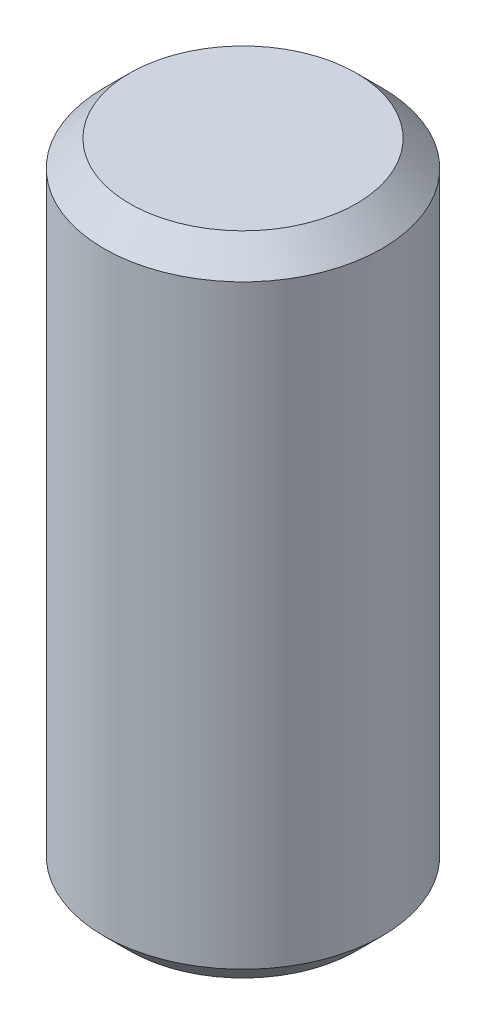
ISO-10303-21;
HEADER;
FILE_DESCRIPTION(('STEP AP214'),'2;1');
FILE_NAME('part.step','',(''),(''),'','','');
FILE_SCHEMA(('AUTOMOTIVE_DESIGN { 1 0 10303 214 1 1 1 1 }'));
ENDSEC;
DATA;
#1=APPLICATION_CONTEXT('core data for automotive mechanical design processes');
#2=APPLICATION_PROTOCOL_DEFINITION('international standard','automotive_design',2000,#1);
#3=PRODUCT_CONTEXT('',#1,'mechanical');
#4=PRODUCT('Part','Part','',(#3));
#5=PRODUCT_RELATED_PRODUCT_CATEGORY('part','',(#4));
#6=PRODUCT_DEFINITION_FORMATION('','',#4);
#7=PRODUCT_DEFINITION_CONTEXT('part definition',#1,'design');
#8=PRODUCT_DEFINITION('design','',#6,#7);
#9=PRODUCT_DEFINITION_SHAPE('','',#8);
#10=(LENGTH_UNIT() NAMED_UNIT(*) SI_UNIT(.MILLI.,.METRE.));
#11=(NAMED_UNIT(*) PLANE_ANGLE_UNIT() SI_UNIT($,.RADIAN.));
#12=(NAMED_UNIT(*) SI_UNIT($,.STERADIAN.) SOLID_ANGLE_UNIT());
#13=UNCERTAINTY_MEASURE_WITH_UNIT(LENGTH_MEASURE(1.E-05),#10,'distance_accuracy_value','');
#14=(GEOMETRIC_REPRESENTATION_CONTEXT(3) GLOBAL_UNCERTAINTY_ASSIGNED_CONTEXT((#13)) GLOBAL_UNIT_ASSIGNED_CONTEXT((#10,
#11,#12)) REPRESENTATION_CONTEXT('',''));
#15=CARTESIAN_POINT('',(0.,0.,0.));
#16=DIRECTION('',(0.,0.,1.));
#17=DIRECTION('',(1.,0.,0.));
#18=AXIS2_PLACEMENT_3D('',#15,#16,#17);
#19=CARTESIAN_POINT('',(0.,-6.35,0.));
#20=DIRECTION('',(0.,1.,0.));
#21=DIRECTION('',(0.,0.,1.));
#22=AXIS2_PLACEMENT_3D('',#19,#20,#21);
#23=PLANE('',#22);
#24=CARTESIAN_POINT('',(0.,-6.35,0.));
#25=DIRECTION('',(0.,1.,0.));
#26=DIRECTION('',(0.,0.,1.));
#27=AXIS2_PLACEMENT_3D('',#24,#25,#26);
#28=CIRCLE('',#27,2.2225);
#29=CARTESIAN_POINT('',(0.,-6.35,2.2225));
#30=VERTEX_POINT('',#29);
#31=EDGE_CURVE('E37',#30,#30,#28,.F.);
#32=ORIENTED_EDGE('',*,*,#31,.T.);
#33=EDGE_LOOP('',(#32));
#34=FACE_BOUND('',#33,.T.);
#35=ADVANCED_FACE('F30',(#34),#23,.F.);
#36=CARTESIAN_POINT('',(0.,6.08020788678209,0.));
#37=DIRECTION('',(0.,1.,0.));
#38=DIRECTION('',(0.,0.,1.));
#39=AXIS2_PLACEMENT_3D('',#36,#37,#38);
#40=CYLINDRICAL_SURFACE('',#39,2.7305);
#41=CARTESIAN_POINT('',(0.,-5.842,0.));
#42=DIRECTION('',(0.,1.,0.));
#43=DIRECTION('',(0.,0.,1.));
#44=AXIS2_PLACEMENT_3D('',#41,#42,#43);
#45=CIRCLE('',#44,2.7305);
#46=CARTESIAN_POINT('',(0.,-5.842,2.7305));
#47=VERTEX_POINT('',#46);
#48=EDGE_CURVE('E41',#47,#47,#45,.T.);
#49=ORIENTED_EDGE('',*,*,#48,.T.);
#50=EDGE_LOOP('',(#49));
#51=FACE_BOUND('',#50,.T.);
#52=CARTESIAN_POINT('',(0.,5.842,0.));
#53=DIRECTION('',(0.,-1.,0.));
#54=DIRECTION('',(0.,0.,-1.));
#55=AXIS2_PLACEMENT_3D('',#52,#53,#54);
#56=CIRCLE('',#55,2.7305);
#57=CARTESIAN_POINT('',(0.,5.842,-2.7305));
#58=VERTEX_POINT('',#57);
#59=EDGE_CURVE('E45',#58,#58,#56,.T.);
#60=ORIENTED_EDGE('',*,*,#59,.T.);
#61=EDGE_LOOP('',(#60));
#62=FACE_BOUND('',#61,.T.);
#63=ADVANCED_FACE('F51',(#51,#62),#40,.T.);
#64=CARTESIAN_POINT('',(2.7305,6.35,0.));
#65=DIRECTION('',(0.,-1.,0.));
#66=DIRECTION('',(0.,0.,-1.));
#67=AXIS2_PLACEMENT_3D('',#64,#65,#66);
#68=PLANE('',#67);
#69=CARTESIAN_POINT('',(0.,6.35,0.));
#70=DIRECTION('',(0.,-1.,0.));
#71=DIRECTION('',(0.,0.,-1.));
#72=AXIS2_PLACEMENT_3D('',#69,#70,#71);
#73=CIRCLE('',#72,2.2225);
#74=CARTESIAN_POINT('',(0.,6.35,-2.2225));
#75=VERTEX_POINT('',#74);
#76=EDGE_CURVE('E10',#75,#75,#73,.F.);
#77=ORIENTED_EDGE('',*,*,#76,.T.);
#78=EDGE_LOOP('',(#77));
#79=FACE_BOUND('',#78,.T.);
#80=ADVANCED_FACE('F59',(#79),#68,.F.);
#81=CARTESIAN_POINT('',(0.,-5.842,0.));
#82=DIRECTION('',(0.,1.,0.));
#83=DIRECTION('',(0.,0.,1.));
#84=AXIS2_PLACEMENT_3D('',#81,#82,#83);
#85=CONICAL_SURFACE('',#84,2.7305,0.785398163397449);
#86=ORIENTED_EDGE('',*,*,#31,.F.);
#87=EDGE_LOOP('',(#86));
#88=FACE_BOUND('',#87,.T.);
#89=ORIENTED_EDGE('',*,*,#48,.F.);
#90=EDGE_LOOP('',(#89));
#91=FACE_BOUND('',#90,.T.);
#92=ADVANCED_FACE('F55',(#88,#91),#85,.T.);
#93=CARTESIAN_POINT('',(0.,6.35,0.));
#94=DIRECTION('',(0.,-1.,0.));
#95=DIRECTION('',(0.,0.,-1.));
#96=AXIS2_PLACEMENT_3D('',#93,#94,#95);
#97=CONICAL_SURFACE('',#96,2.2225,0.785398163397447);
#98=ORIENTED_EDGE('',*,*,#59,.F.);
#99=EDGE_LOOP('',(#98));
#100=FACE_BOUND('',#99,.T.);
#101=ORIENTED_EDGE('',*,*,#76,.F.);
#102=EDGE_LOOP('',(#101));
#103=FACE_BOUND('',#102,.T.);
#104=ADVANCED_FACE('F32',(#100,#103),#97,.T.);
#105=CLOSED_SHELL('',(#35,#63,#80,#92,#104));
#106=MANIFOLD_SOLID_BREP('B2',#105);
#107=ADVANCED_BREP_SHAPE_REPRESENTATION('',(#18,#106),#14);
#108=SHAPE_DEFINITION_REPRESENTATION(#9,#107);
ENDSEC;
END-ISO-10303-21;
